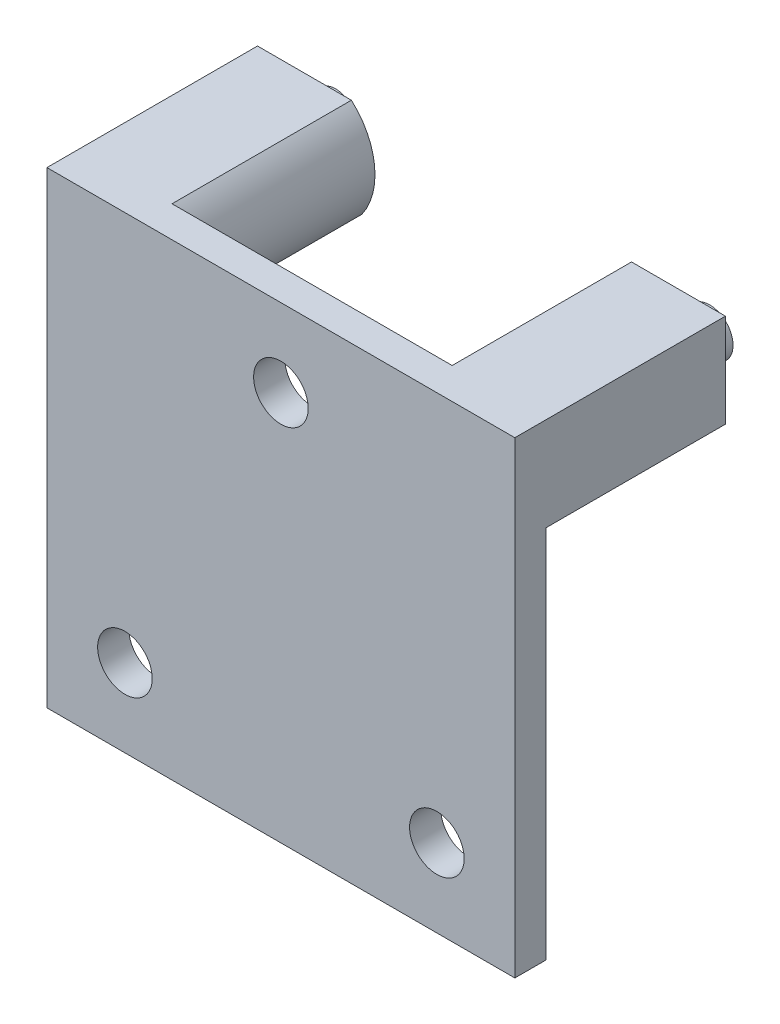
ISO-10303-21;
HEADER;
FILE_DESCRIPTION(('STEP AP214'),'2;1');
FILE_NAME('part.step','',(''),(''),'','','');
FILE_SCHEMA(('AUTOMOTIVE_DESIGN { 1 0 10303 214 1 1 1 1 }'));
ENDSEC;
DATA;
#1=APPLICATION_CONTEXT('core data for automotive mechanical design processes');
#2=APPLICATION_PROTOCOL_DEFINITION('international standard','automotive_design',2000,#1);
#3=PRODUCT_CONTEXT('',#1,'mechanical');
#4=PRODUCT('Part','Part','',(#3));
#5=PRODUCT_RELATED_PRODUCT_CATEGORY('part','',(#4));
#6=PRODUCT_DEFINITION_FORMATION('','',#4);
#7=PRODUCT_DEFINITION_CONTEXT('part definition',#1,'design');
#8=PRODUCT_DEFINITION('design','',#6,#7);
#9=PRODUCT_DEFINITION_SHAPE('','',#8);
#10=(LENGTH_UNIT() NAMED_UNIT(*) SI_UNIT(.MILLI.,.METRE.));
#11=(NAMED_UNIT(*) PLANE_ANGLE_UNIT() SI_UNIT($,.RADIAN.));
#12=(NAMED_UNIT(*) SI_UNIT($,.STERADIAN.) SOLID_ANGLE_UNIT());
#13=UNCERTAINTY_MEASURE_WITH_UNIT(LENGTH_MEASURE(1.E-05),#10,'distance_accuracy_value','');
#14=(GEOMETRIC_REPRESENTATION_CONTEXT(3) GLOBAL_UNCERTAINTY_ASSIGNED_CONTEXT((#13)) GLOBAL_UNIT_ASSIGNED_CONTEXT((#10,
#11,#12)) REPRESENTATION_CONTEXT('',''));
#15=CARTESIAN_POINT('',(0.,0.,0.));
#16=DIRECTION('',(0.,0.,1.));
#17=DIRECTION('',(1.,0.,0.));
#18=AXIS2_PLACEMENT_3D('',#15,#16,#17);
#19=CARTESIAN_POINT('',(-0.00991820608002309,-5.87499477855901,2.));
#20=DIRECTION('',(1.,0.,0.));
#21=DIRECTION('',(0.,0.,-1.));
#22=AXIS2_PLACEMENT_3D('',#19,#20,#21);
#23=PLANE('',#22);
#24=DIRECTION('',(0.,0.,-1.));
#25=VECTOR('',#24,1.);
#26=CARTESIAN_POINT('',(-0.00991820608002309,24.125005221441,2.));
#27=LINE('',#26,#25);
#28=CARTESIAN_POINT('',(-0.00991820608002309,24.125005221441,2.));
#29=VERTEX_POINT('',#28);
#30=CARTESIAN_POINT('',(-0.00991820608002309,24.125005221441,-11.5));
#31=VERTEX_POINT('',#30);
#32=EDGE_CURVE('E123',#29,#31,#27,.T.);
#33=ORIENTED_EDGE('',*,*,#32,.T.);
#34=DIRECTION('',(0.,1.,0.));
#35=VECTOR('',#34,1.);
#36=CARTESIAN_POINT('',(-0.00991820608002309,24.125005221441,-11.5));
#37=LINE('',#36,#35);
#38=CARTESIAN_POINT('',(-0.00991820608002309,18.125005221441,-11.5));
#39=VERTEX_POINT('',#38);
#40=EDGE_CURVE('E168',#39,#31,#37,.T.);
#41=ORIENTED_EDGE('',*,*,#40,.F.);
#42=DIRECTION('',(0.,0.,1.));
#43=VECTOR('',#42,1.);
#44=CARTESIAN_POINT('',(-0.00991820608002309,18.125005221441,-11.5));
#45=LINE('',#44,#43);
#46=CARTESIAN_POINT('',(-0.00991820608002309,18.125005221441,0.));
#47=VERTEX_POINT('',#46);
#48=EDGE_CURVE('E171',#39,#47,#45,.T.);
#49=ORIENTED_EDGE('',*,*,#48,.T.);
#50=DIRECTION('',(0.,-1.,0.));
#51=VECTOR('',#50,1.);
#52=CARTESIAN_POINT('',(-0.00991820608002309,-5.87499477855901,0.));
#53=LINE('',#52,#51);
#54=CARTESIAN_POINT('',(-0.00991820608002309,-5.87499477855901,0.));
#55=VERTEX_POINT('',#54);
#56=EDGE_CURVE('E199',#47,#55,#53,.T.);
#57=ORIENTED_EDGE('',*,*,#56,.T.);
#58=DIRECTION('',(0.,0.,-1.));
#59=VECTOR('',#58,1.);
#60=CARTESIAN_POINT('',(-0.00991820608002309,-5.87499477855901,2.));
#61=LINE('',#60,#59);
#62=CARTESIAN_POINT('',(-0.00991820608002309,-5.87499477855901,2.));
#63=VERTEX_POINT('',#62);
#64=EDGE_CURVE('E196',#63,#55,#61,.T.);
#65=ORIENTED_EDGE('',*,*,#64,.F.);
#66=DIRECTION('',(0.,-1.,0.));
#67=VECTOR('',#66,1.);
#68=CARTESIAN_POINT('',(-0.00991820608002309,-5.87499477855901,2.));
#69=LINE('',#68,#67);
#70=EDGE_CURVE('E187',#29,#63,#69,.T.);
#71=ORIENTED_EDGE('',*,*,#70,.F.);
#72=EDGE_LOOP('',(#33,#41,#49,#57,#65,#71));
#73=FACE_BOUND('',#72,.T.);
#74=ADVANCED_FACE('F35',(#73),#23,.F.);
#75=CARTESIAN_POINT('',(29.99008179392,-5.87499477855901,2.));
#76=DIRECTION('',(0.,1.,0.));
#77=DIRECTION('',(-1.,0.,0.));
#78=AXIS2_PLACEMENT_3D('',#75,#76,#77);
#79=PLANE('',#78);
#80=DIRECTION('',(1.,0.,0.));
#81=VECTOR('',#80,1.);
#82=CARTESIAN_POINT('',(29.99008179392,-5.87499477855901,0.));
#83=LINE('',#82,#81);
#84=CARTESIAN_POINT('',(29.99008179392,-5.87499477855901,0.));
#85=VERTEX_POINT('',#84);
#86=EDGE_CURVE('E202',#55,#85,#83,.T.);
#87=ORIENTED_EDGE('',*,*,#86,.T.);
#88=DIRECTION('',(0.,0.,-1.));
#89=VECTOR('',#88,1.);
#90=CARTESIAN_POINT('',(29.99008179392,-5.87499477855901,2.));
#91=LINE('',#90,#89);
#92=CARTESIAN_POINT('',(29.99008179392,-5.87499477855901,2.));
#93=VERTEX_POINT('',#92);
#94=EDGE_CURVE('E122',#93,#85,#91,.T.);
#95=ORIENTED_EDGE('',*,*,#94,.F.);
#96=DIRECTION('',(1.,0.,0.));
#97=VECTOR('',#96,1.);
#98=CARTESIAN_POINT('',(29.99008179392,-5.87499477855901,2.));
#99=LINE('',#98,#97);
#100=EDGE_CURVE('E253',#63,#93,#99,.T.);
#101=ORIENTED_EDGE('',*,*,#100,.F.);
#102=ORIENTED_EDGE('',*,*,#64,.T.);
#103=EDGE_LOOP('',(#87,#95,#101,#102));
#104=FACE_BOUND('',#103,.T.);
#105=ADVANCED_FACE('F230',(#104),#79,.F.);
#106=CARTESIAN_POINT('',(29.99008179392,-5.87499477855901,2.));
#107=DIRECTION('',(-1.,0.,0.));
#108=DIRECTION('',(0.,0.,1.));
#109=AXIS2_PLACEMENT_3D('',#106,#107,#108);
#110=PLANE('',#109);
#111=DIRECTION('',(0.,1.,0.));
#112=VECTOR('',#111,1.);
#113=CARTESIAN_POINT('',(29.99008179392,-5.87499477855901,0.));
#114=LINE('',#113,#112);
#115=CARTESIAN_POINT('',(29.99008179392,18.125005221441,0.));
#116=VERTEX_POINT('',#115);
#117=EDGE_CURVE('E188',#85,#116,#114,.T.);
#118=ORIENTED_EDGE('',*,*,#117,.T.);
#119=DIRECTION('',(0.,0.,1.));
#120=VECTOR('',#119,1.);
#121=CARTESIAN_POINT('',(29.99008179392,18.125005221441,-11.5));
#122=LINE('',#121,#120);
#123=CARTESIAN_POINT('',(29.99008179392,18.125005221441,-11.5));
#124=VERTEX_POINT('',#123);
#125=EDGE_CURVE('E137',#124,#116,#122,.T.);
#126=ORIENTED_EDGE('',*,*,#125,.F.);
#127=DIRECTION('',(0.,1.,0.));
#128=VECTOR('',#127,1.);
#129=CARTESIAN_POINT('',(29.99008179392,24.125005221441,-11.5));
#130=LINE('',#129,#128);
#131=CARTESIAN_POINT('',(29.99008179392,24.125005221441,-11.5));
#132=VERTEX_POINT('',#131);
#133=EDGE_CURVE('E129',#124,#132,#130,.T.);
#134=ORIENTED_EDGE('',*,*,#133,.T.);
#135=DIRECTION('',(0.,0.,-1.));
#136=VECTOR('',#135,1.);
#137=CARTESIAN_POINT('',(29.99008179392,24.125005221441,2.));
#138=LINE('',#137,#136);
#139=CARTESIAN_POINT('',(29.99008179392,24.125005221441,2.));
#140=VERTEX_POINT('',#139);
#141=EDGE_CURVE('E112',#140,#132,#138,.T.);
#142=ORIENTED_EDGE('',*,*,#141,.F.);
#143=DIRECTION('',(0.,1.,0.));
#144=VECTOR('',#143,1.);
#145=CARTESIAN_POINT('',(29.99008179392,-5.87499477855901,2.));
#146=LINE('',#145,#144);
#147=EDGE_CURVE('E255',#93,#140,#146,.T.);
#148=ORIENTED_EDGE('',*,*,#147,.F.);
#149=ORIENTED_EDGE('',*,*,#94,.T.);
#150=EDGE_LOOP('',(#118,#126,#134,#142,#148,#149));
#151=FACE_BOUND('',#150,.T.);
#152=ADVANCED_FACE('F136',(#151),#110,.F.);
#153=CARTESIAN_POINT('',(29.99008179392,24.125005221441,2.));
#154=DIRECTION('',(0.,-1.,0.));
#155=DIRECTION('',(0.,0.,-1.));
#156=AXIS2_PLACEMENT_3D('',#153,#154,#155);
#157=PLANE('',#156);
#158=ORIENTED_EDGE('',*,*,#141,.T.);
#159=DIRECTION('',(-1.,0.,0.));
#160=VECTOR('',#159,1.);
#161=CARTESIAN_POINT('',(29.99008179392,24.125005221441,-11.5));
#162=LINE('',#161,#160);
#163=CARTESIAN_POINT('',(23.9702421417599,24.125005221441,-11.5));
#164=VERTEX_POINT('',#163);
#165=EDGE_CURVE('E115',#132,#164,#162,.T.);
#166=ORIENTED_EDGE('',*,*,#165,.T.);
#167=DIRECTION('',(0.,0.,1.));
#168=VECTOR('',#167,1.);
#169=CARTESIAN_POINT('',(23.9702421417599,24.125005221441,-11.5));
#170=LINE('',#169,#168);
#171=CARTESIAN_POINT('',(23.9702421417599,24.125005221441,0.));
#172=VERTEX_POINT('',#171);
#173=EDGE_CURVE('E144',#164,#172,#170,.T.);
#174=ORIENTED_EDGE('',*,*,#173,.T.);
#175=DIRECTION('',(-1.,0.,0.));
#176=VECTOR('',#175,1.);
#177=CARTESIAN_POINT('',(29.99008179392,24.125005221441,0.));
#178=LINE('',#177,#176);
#179=CARTESIAN_POINT('',(6.00992144608002,24.125005221441,0.));
#180=VERTEX_POINT('',#179);
#181=EDGE_CURVE('E57',#172,#180,#178,.T.);
#182=ORIENTED_EDGE('',*,*,#181,.T.);
#183=DIRECTION('',(0.,0.,1.));
#184=VECTOR('',#183,1.);
#185=CARTESIAN_POINT('',(6.00992144608002,24.125005221441,-11.5));
#186=LINE('',#185,#184);
#187=CARTESIAN_POINT('',(6.00992144608002,24.125005221441,-11.5));
#188=VERTEX_POINT('',#187);
#189=EDGE_CURVE('E203',#188,#180,#186,.T.);
#190=ORIENTED_EDGE('',*,*,#189,.F.);
#191=DIRECTION('',(1.,0.,0.));
#192=VECTOR('',#191,1.);
#193=CARTESIAN_POINT('',(-0.00991820608002309,24.125005221441,-11.5));
#194=LINE('',#193,#192);
#195=EDGE_CURVE('E160',#31,#188,#194,.T.);
#196=ORIENTED_EDGE('',*,*,#195,.F.);
#197=ORIENTED_EDGE('',*,*,#32,.F.);
#198=DIRECTION('',(-1.,0.,0.));
#199=VECTOR('',#198,1.);
#200=CARTESIAN_POINT('',(29.99008179392,24.125005221441,2.));
#201=LINE('',#200,#199);
#202=EDGE_CURVE('E118',#140,#29,#201,.T.);
#203=ORIENTED_EDGE('',*,*,#202,.F.);
#204=EDGE_LOOP('',(#158,#166,#174,#182,#190,#196,#197,#203));
#205=FACE_BOUND('',#204,.T.);
#206=ADVANCED_FACE('F114',(#205),#157,.F.);
#207=CARTESIAN_POINT('',(0.,0.,2.));
#208=DIRECTION('',(0.,0.,1.));
#209=DIRECTION('',(1.,0.,0.));
#210=AXIS2_PLACEMENT_3D('',#207,#208,#209);
#211=PLANE('',#210);
#212=CARTESIAN_POINT('',(14.99008179392,19.125005221441,2.));
#213=DIRECTION('',(0.,0.,-1.));
#214=DIRECTION('',(-1.,0.,0.));
#215=AXIS2_PLACEMENT_3D('',#212,#213,#214);
#216=CIRCLE('',#215,1.75);
#217=CARTESIAN_POINT('',(13.24008179392,19.125005221441,2.));
#218=VERTEX_POINT('',#217);
#219=EDGE_CURVE('E411',#218,#218,#216,.T.);
#220=ORIENTED_EDGE('',*,*,#219,.T.);
#221=EDGE_LOOP('',(#220));
#222=FACE_BOUND('',#221,.T.);
#223=CARTESIAN_POINT('',(4.99008179391998,-0.874994778559009,2.));
#224=DIRECTION('',(0.,0.,-1.));
#225=DIRECTION('',(1.,0.,0.));
#226=AXIS2_PLACEMENT_3D('',#223,#224,#225);
#227=CIRCLE('',#226,1.75);
#228=CARTESIAN_POINT('',(6.74008179391998,-0.874994778559009,2.));
#229=VERTEX_POINT('',#228);
#230=EDGE_CURVE('E419',#229,#229,#227,.T.);
#231=ORIENTED_EDGE('',*,*,#230,.T.);
#232=EDGE_LOOP('',(#231));
#233=FACE_BOUND('',#232,.T.);
#234=CARTESIAN_POINT('',(24.99008179392,-0.874994778559009,2.));
#235=DIRECTION('',(0.,0.,-1.));
#236=DIRECTION('',(-1.,0.,0.));
#237=AXIS2_PLACEMENT_3D('',#234,#235,#236);
#238=CIRCLE('',#237,1.75);
#239=CARTESIAN_POINT('',(23.24008179392,-0.874994778559009,2.));
#240=VERTEX_POINT('',#239);
#241=EDGE_CURVE('E425',#240,#240,#238,.T.);
#242=ORIENTED_EDGE('',*,*,#241,.T.);
#243=EDGE_LOOP('',(#242));
#244=FACE_BOUND('',#243,.T.);
#245=ORIENTED_EDGE('',*,*,#70,.T.);
#246=ORIENTED_EDGE('',*,*,#100,.T.);
#247=ORIENTED_EDGE('',*,*,#147,.T.);
#248=ORIENTED_EDGE('',*,*,#202,.T.);
#249=EDGE_LOOP('',(#245,#246,#247,#248));
#250=FACE_BOUND('',#249,.T.);
#251=ADVANCED_FACE('F257',(#222,#233,#244,#250),#211,.T.);
#252=CARTESIAN_POINT('',(0.,0.,0.));
#253=DIRECTION('',(0.,0.,1.));
#254=DIRECTION('',(1.,0.,0.));
#255=AXIS2_PLACEMENT_3D('',#252,#253,#254);
#256=PLANE('',#255);
#257=CARTESIAN_POINT('',(14.99008179392,19.125005221441,0.));
#258=DIRECTION('',(0.,0.,-1.));
#259=DIRECTION('',(-1.,0.,0.));
#260=AXIS2_PLACEMENT_3D('',#257,#258,#259);
#261=CIRCLE('',#260,1.75);
#262=CARTESIAN_POINT('',(13.24008179392,19.125005221441,0.));
#263=VERTEX_POINT('',#262);
#264=EDGE_CURVE('E414',#263,#263,#261,.T.);
#265=ORIENTED_EDGE('',*,*,#264,.F.);
#266=EDGE_LOOP('',(#265));
#267=FACE_BOUND('',#266,.T.);
#268=CARTESIAN_POINT('',(4.99008179391998,-0.874994778559009,0.));
#269=DIRECTION('',(0.,0.,-1.));
#270=DIRECTION('',(1.,0.,0.));
#271=AXIS2_PLACEMENT_3D('',#268,#269,#270);
#272=CIRCLE('',#271,1.75);
#273=CARTESIAN_POINT('',(6.74008179391998,-0.874994778559009,0.));
#274=VERTEX_POINT('',#273);
#275=EDGE_CURVE('E416',#274,#274,#272,.T.);
#276=ORIENTED_EDGE('',*,*,#275,.F.);
#277=EDGE_LOOP('',(#276));
#278=FACE_BOUND('',#277,.T.);
#279=CARTESIAN_POINT('',(24.99008179392,-0.874994778559009,0.));
#280=DIRECTION('',(0.,0.,-1.));
#281=DIRECTION('',(-1.,0.,0.));
#282=AXIS2_PLACEMENT_3D('',#279,#280,#281);
#283=CIRCLE('',#282,1.75);
#284=CARTESIAN_POINT('',(23.24008179392,-0.874994778559009,0.));
#285=VERTEX_POINT('',#284);
#286=EDGE_CURVE('E422',#285,#285,#283,.T.);
#287=ORIENTED_EDGE('',*,*,#286,.F.);
#288=EDGE_LOOP('',(#287));
#289=FACE_BOUND('',#288,.T.);
#290=CARTESIAN_POINT('',(13.707999,3.46499688,0.));
#291=DIRECTION('',(0.,0.,1.));
#292=DIRECTION('',(1.,0.,0.));
#293=AXIS2_PLACEMENT_3D('',#290,#291,#292);
#294=CIRCLE('',#293,5.);
#295=CARTESIAN_POINT('',(18.707999,3.46499688,0.));
#296=VERTEX_POINT('',#295);
#297=EDGE_CURVE('E11',#296,#296,#294,.F.);
#298=ORIENTED_EDGE('',*,*,#297,.F.);
#299=EDGE_LOOP('',(#298));
#300=FACE_BOUND('',#299,.T.);
#301=CARTESIAN_POINT('',(26.98016196784,20.74999914,0.));
#302=DIRECTION('',(0.,0.,1.));
#303=DIRECTION('',(1.,0.,0.));
#304=AXIS2_PLACEMENT_3D('',#301,#302,#303);
#305=CIRCLE('',#304,4.52219895727657);
#306=CARTESIAN_POINT('',(23.2978134866772,18.125005221441,0.));
#307=VERTEX_POINT('',#306);
#308=EDGE_CURVE('E133',#172,#307,#305,.T.);
#309=ORIENTED_EDGE('',*,*,#308,.T.);
#310=DIRECTION('',(1.,0.,0.));
#311=VECTOR('',#310,1.);
#312=CARTESIAN_POINT('',(29.99008179392,18.125005221441,0.));
#313=LINE('',#312,#311);
#314=EDGE_CURVE('E49',#307,#116,#313,.T.);
#315=ORIENTED_EDGE('',*,*,#314,.T.);
#316=ORIENTED_EDGE('',*,*,#117,.F.);
#317=ORIENTED_EDGE('',*,*,#86,.F.);
#318=ORIENTED_EDGE('',*,*,#56,.F.);
#319=DIRECTION('',(-1.,0.,0.));
#320=VECTOR('',#319,1.);
#321=CARTESIAN_POINT('',(-0.00991820608002309,18.125005221441,0.));
#322=LINE('',#321,#320);
#323=CARTESIAN_POINT('',(6.68235010116273,18.125005221441,0.));
#324=VERTEX_POINT('',#323);
#325=EDGE_CURVE('E164',#324,#47,#322,.T.);
#326=ORIENTED_EDGE('',*,*,#325,.F.);
#327=CARTESIAN_POINT('',(3.00000162,20.74999914,0.));
#328=DIRECTION('',(0.,0.,-1.));
#329=DIRECTION('',(-1.,0.,0.));
#330=AXIS2_PLACEMENT_3D('',#327,#328,#329);
#331=CIRCLE('',#330,4.52219895727657);
#332=EDGE_CURVE('E157',#180,#324,#331,.T.);
#333=ORIENTED_EDGE('',*,*,#332,.F.);
#334=ORIENTED_EDGE('',*,*,#181,.F.);
#335=EDGE_LOOP('',(#309,#315,#316,#317,#318,#326,#333,#334));
#336=FACE_BOUND('',#335,.T.);
#337=ADVANCED_FACE('F213',(#267,#278,#289,#300,#336),#256,.F.);
#338=CARTESIAN_POINT('',(3.00000162,20.74999914,-11.5));
#339=DIRECTION('',(0.,0.,1.));
#340=DIRECTION('',(1.,0.,0.));
#341=AXIS2_PLACEMENT_3D('',#338,#339,#340);
#342=CYLINDRICAL_SURFACE('',#341,4.52219895727657);
#343=ORIENTED_EDGE('',*,*,#332,.T.);
#344=DIRECTION('',(0.,0.,1.));
#345=VECTOR('',#344,1.);
#346=CARTESIAN_POINT('',(6.68235010116273,18.125005221441,-11.5));
#347=LINE('',#346,#345);
#348=CARTESIAN_POINT('',(6.68235010116273,18.125005221441,-11.5));
#349=VERTEX_POINT('',#348);
#350=EDGE_CURVE('E174',#349,#324,#347,.T.);
#351=ORIENTED_EDGE('',*,*,#350,.F.);
#352=CARTESIAN_POINT('',(3.00000162,20.74999914,-11.5));
#353=DIRECTION('',(0.,0.,-1.));
#354=DIRECTION('',(-1.,0.,0.));
#355=AXIS2_PLACEMENT_3D('',#352,#353,#354);
#356=CIRCLE('',#355,4.52219895727657);
#357=EDGE_CURVE('E163',#188,#349,#356,.T.);
#358=ORIENTED_EDGE('',*,*,#357,.F.);
#359=ORIENTED_EDGE('',*,*,#189,.T.);
#360=EDGE_LOOP('',(#343,#351,#358,#359));
#361=FACE_BOUND('',#360,.T.);
#362=ADVANCED_FACE('F252',(#361),#342,.T.);
#363=CARTESIAN_POINT('',(-0.00991820608002309,18.125005221441,-11.5));
#364=DIRECTION('',(0.,1.,0.));
#365=DIRECTION('',(0.,0.,1.));
#366=AXIS2_PLACEMENT_3D('',#363,#364,#365);
#367=PLANE('',#366);
#368=ORIENTED_EDGE('',*,*,#325,.T.);
#369=ORIENTED_EDGE('',*,*,#48,.F.);
#370=DIRECTION('',(-1.,0.,0.));
#371=VECTOR('',#370,1.);
#372=CARTESIAN_POINT('',(-0.00991820608002309,18.125005221441,-11.5));
#373=LINE('',#372,#371);
#374=EDGE_CURVE('E166',#349,#39,#373,.T.);
#375=ORIENTED_EDGE('',*,*,#374,.F.);
#376=ORIENTED_EDGE('',*,*,#350,.T.);
#377=EDGE_LOOP('',(#368,#369,#375,#376));
#378=FACE_BOUND('',#377,.T.);
#379=ADVANCED_FACE('F251',(#378),#367,.F.);
#380=CARTESIAN_POINT('',(3.00000162,20.74999914,-11.5));
#381=DIRECTION('',(0.,0.,-1.));
#382=DIRECTION('',(-1.,0.,0.));
#383=AXIS2_PLACEMENT_3D('',#380,#381,#382);
#384=PLANE('',#383);
#385=CARTESIAN_POINT('',(3.00000162,20.74999914,-11.5));
#386=DIRECTION('',(0.,0.,-1.));
#387=DIRECTION('',(-1.,0.,0.));
#388=AXIS2_PLACEMENT_3D('',#385,#386,#387);
#389=CIRCLE('',#388,1.5);
#390=CARTESIAN_POINT('',(1.50000162,20.74999914,-11.5));
#391=VERTEX_POINT('',#390);
#392=EDGE_CURVE('E153',#391,#391,#389,.T.);
#393=ORIENTED_EDGE('',*,*,#392,.F.);
#394=EDGE_LOOP('',(#393));
#395=FACE_BOUND('',#394,.T.);
#396=ORIENTED_EDGE('',*,*,#195,.T.);
#397=ORIENTED_EDGE('',*,*,#357,.T.);
#398=ORIENTED_EDGE('',*,*,#374,.T.);
#399=ORIENTED_EDGE('',*,*,#40,.T.);
#400=EDGE_LOOP('',(#396,#397,#398,#399));
#401=FACE_BOUND('',#400,.T.);
#402=ADVANCED_FACE('F241',(#395,#401),#384,.T.);
#403=CARTESIAN_POINT('',(3.00000162,20.74999914,-13.5));
#404=DIRECTION('',(0.,0.,1.));
#405=DIRECTION('',(1.,0.,0.));
#406=AXIS2_PLACEMENT_3D('',#403,#404,#405);
#407=CYLINDRICAL_SURFACE('',#406,1.5);
#408=CARTESIAN_POINT('',(3.00000162,20.74999914,-13.5));
#409=DIRECTION('',(0.,0.,-1.));
#410=DIRECTION('',(-1.,0.,0.));
#411=AXIS2_PLACEMENT_3D('',#408,#409,#410);
#412=CIRCLE('',#411,1.5);
#413=CARTESIAN_POINT('',(1.50000162,20.74999914,-13.5));
#414=VERTEX_POINT('',#413);
#415=EDGE_CURVE('E154',#414,#414,#412,.T.);
#416=ORIENTED_EDGE('',*,*,#415,.F.);
#417=EDGE_LOOP('',(#416));
#418=FACE_BOUND('',#417,.T.);
#419=ORIENTED_EDGE('',*,*,#392,.T.);
#420=EDGE_LOOP('',(#419));
#421=FACE_BOUND('',#420,.T.);
#422=ADVANCED_FACE('F226',(#418,#421),#407,.T.);
#423=CARTESIAN_POINT('',(3.00000162,20.74999914,-13.5));
#424=DIRECTION('',(0.,0.,-1.));
#425=DIRECTION('',(-1.,0.,0.));
#426=AXIS2_PLACEMENT_3D('',#423,#424,#425);
#427=PLANE('',#426);
#428=ORIENTED_EDGE('',*,*,#415,.T.);
#429=EDGE_LOOP('',(#428));
#430=FACE_BOUND('',#429,.T.);
#431=ADVANCED_FACE('F219',(#430),#427,.T.);
#432=CARTESIAN_POINT('',(29.99008179392,18.125005221441,-11.5));
#433=DIRECTION('',(0.,-1.,0.));
#434=DIRECTION('',(0.,0.,-1.));
#435=AXIS2_PLACEMENT_3D('',#432,#433,#434);
#436=PLANE('',#435);
#437=ORIENTED_EDGE('',*,*,#314,.F.);
#438=DIRECTION('',(0.,0.,1.));
#439=VECTOR('',#438,1.);
#440=CARTESIAN_POINT('',(23.2978134866772,18.125005221441,-11.5));
#441=LINE('',#440,#439);
#442=CARTESIAN_POINT('',(23.2978134866772,18.125005221441,-11.5));
#443=VERTEX_POINT('',#442);
#444=EDGE_CURVE('E150',#443,#307,#441,.T.);
#445=ORIENTED_EDGE('',*,*,#444,.F.);
#446=DIRECTION('',(1.,0.,0.));
#447=VECTOR('',#446,1.);
#448=CARTESIAN_POINT('',(29.99008179392,18.125005221441,-11.5));
#449=LINE('',#448,#447);
#450=EDGE_CURVE('E138',#443,#124,#449,.T.);
#451=ORIENTED_EDGE('',*,*,#450,.T.);
#452=ORIENTED_EDGE('',*,*,#125,.T.);
#453=EDGE_LOOP('',(#437,#445,#451,#452));
#454=FACE_BOUND('',#453,.T.);
#455=ADVANCED_FACE('F217',(#454),#436,.T.);
#456=CARTESIAN_POINT('',(26.98016196784,20.74999914,-11.5));
#457=DIRECTION('',(0.,0.,1.));
#458=DIRECTION('',(1.,0.,0.));
#459=AXIS2_PLACEMENT_3D('',#456,#457,#458);
#460=CYLINDRICAL_SURFACE('',#459,4.52219895727657);
#461=ORIENTED_EDGE('',*,*,#308,.F.);
#462=ORIENTED_EDGE('',*,*,#173,.F.);
#463=CARTESIAN_POINT('',(26.98016196784,20.74999914,-11.5));
#464=DIRECTION('',(0.,0.,1.));
#465=DIRECTION('',(1.,0.,0.));
#466=AXIS2_PLACEMENT_3D('',#463,#464,#465);
#467=CIRCLE('',#466,4.52219895727657);
#468=EDGE_CURVE('E132',#164,#443,#467,.T.);
#469=ORIENTED_EDGE('',*,*,#468,.T.);
#470=ORIENTED_EDGE('',*,*,#444,.T.);
#471=EDGE_LOOP('',(#461,#462,#469,#470));
#472=FACE_BOUND('',#471,.T.);
#473=ADVANCED_FACE('F216',(#472),#460,.T.);
#474=CARTESIAN_POINT('',(26.98016196784,20.74999914,-11.5));
#475=DIRECTION('',(0.,0.,-1.));
#476=DIRECTION('',(1.,0.,0.));
#477=AXIS2_PLACEMENT_3D('',#474,#475,#476);
#478=PLANE('',#477);
#479=CARTESIAN_POINT('',(26.98016196784,20.74999914,-11.5));
#480=DIRECTION('',(0.,0.,-1.));
#481=DIRECTION('',(-1.,0.,0.));
#482=AXIS2_PLACEMENT_3D('',#479,#480,#481);
#483=CIRCLE('',#482,1.5);
#484=CARTESIAN_POINT('',(25.48016196784,20.74999914,-11.5));
#485=VERTEX_POINT('',#484);
#486=EDGE_CURVE('E42',#485,#485,#483,.T.);
#487=ORIENTED_EDGE('',*,*,#486,.F.);
#488=EDGE_LOOP('',(#487));
#489=FACE_BOUND('',#488,.T.);
#490=ORIENTED_EDGE('',*,*,#165,.F.);
#491=ORIENTED_EDGE('',*,*,#133,.F.);
#492=ORIENTED_EDGE('',*,*,#450,.F.);
#493=ORIENTED_EDGE('',*,*,#468,.F.);
#494=EDGE_LOOP('',(#490,#491,#492,#493));
#495=FACE_BOUND('',#494,.T.);
#496=ADVANCED_FACE('F127',(#489,#495),#478,.T.);
#497=CARTESIAN_POINT('',(26.98016196784,20.74999914,-13.5));
#498=DIRECTION('',(0.,0.,1.));
#499=DIRECTION('',(1.,0.,0.));
#500=AXIS2_PLACEMENT_3D('',#497,#498,#499);
#501=CYLINDRICAL_SURFACE('',#500,1.5);
#502=CARTESIAN_POINT('',(26.98016196784,20.74999914,-13.5));
#503=DIRECTION('',(0.,0.,1.));
#504=DIRECTION('',(1.,0.,0.));
#505=AXIS2_PLACEMENT_3D('',#502,#503,#504);
#506=CIRCLE('',#505,1.5);
#507=CARTESIAN_POINT('',(28.48016196784,20.74999914,-13.5));
#508=VERTEX_POINT('',#507);
#509=EDGE_CURVE('E146',#508,#508,#506,.T.);
#510=ORIENTED_EDGE('',*,*,#509,.T.);
#511=EDGE_LOOP('',(#510));
#512=FACE_BOUND('',#511,.T.);
#513=ORIENTED_EDGE('',*,*,#486,.T.);
#514=EDGE_LOOP('',(#513));
#515=FACE_BOUND('',#514,.T.);
#516=ADVANCED_FACE('F304',(#512,#515),#501,.T.);
#517=CARTESIAN_POINT('',(26.98016196784,20.74999914,-13.5));
#518=DIRECTION('',(0.,0.,-1.));
#519=DIRECTION('',(1.,0.,0.));
#520=AXIS2_PLACEMENT_3D('',#517,#518,#519);
#521=PLANE('',#520);
#522=ORIENTED_EDGE('',*,*,#509,.F.);
#523=EDGE_LOOP('',(#522));
#524=FACE_BOUND('',#523,.T.);
#525=ADVANCED_FACE('F314',(#524),#521,.T.);
#526=CARTESIAN_POINT('',(13.707999,3.46499688,-5.));
#527=DIRECTION('',(0.,0.,-1.));
#528=DIRECTION('',(-1.,0.,0.));
#529=AXIS2_PLACEMENT_3D('',#526,#527,#528);
#530=PLANE('',#529);
#531=CARTESIAN_POINT('',(13.707999,3.46499688,-5.));
#532=DIRECTION('',(0.,0.,-1.));
#533=DIRECTION('',(-1.,0.,0.));
#534=AXIS2_PLACEMENT_3D('',#531,#532,#533);
#535=CIRCLE('',#534,5.);
#536=CARTESIAN_POINT('',(8.707999,3.46499688,-5.));
#537=VERTEX_POINT('',#536);
#538=EDGE_CURVE('E434',#537,#537,#535,.T.);
#539=ORIENTED_EDGE('',*,*,#538,.T.);
#540=EDGE_LOOP('',(#539));
#541=FACE_BOUND('',#540,.T.);
#542=CARTESIAN_POINT('',(13.707999,3.46499688,-5.));
#543=DIRECTION('',(0.,0.,-1.));
#544=DIRECTION('',(-1.,0.,0.));
#545=AXIS2_PLACEMENT_3D('',#542,#543,#544);
#546=CIRCLE('',#545,3.5);
#547=CARTESIAN_POINT('',(10.207999,3.46499688,-5.));
#548=VERTEX_POINT('',#547);
#549=EDGE_CURVE('E431',#548,#548,#546,.T.);
#550=ORIENTED_EDGE('',*,*,#549,.F.);
#551=EDGE_LOOP('',(#550));
#552=FACE_BOUND('',#551,.T.);
#553=ADVANCED_FACE('F324',(#541,#552),#530,.T.);
#554=CARTESIAN_POINT('',(13.707999,3.46499688,-5.));
#555=DIRECTION('',(0.,0.,1.));
#556=DIRECTION('',(1.,0.,0.));
#557=AXIS2_PLACEMENT_3D('',#554,#555,#556);
#558=CYLINDRICAL_SURFACE('',#557,5.);
#559=ORIENTED_EDGE('',*,*,#538,.F.);
#560=EDGE_LOOP('',(#559));
#561=FACE_BOUND('',#560,.T.);
#562=ORIENTED_EDGE('',*,*,#297,.T.);
#563=EDGE_LOOP('',(#562));
#564=FACE_BOUND('',#563,.T.);
#565=ADVANCED_FACE('F335',(#561,#564),#558,.T.);
#566=CARTESIAN_POINT('',(13.707999,3.46499688,-5.));
#567=DIRECTION('',(0.,0.,1.));
#568=DIRECTION('',(1.,0.,0.));
#569=AXIS2_PLACEMENT_3D('',#566,#567,#568);
#570=CYLINDRICAL_SURFACE('',#569,3.5);
#571=ORIENTED_EDGE('',*,*,#549,.T.);
#572=EDGE_LOOP('',(#571));
#573=FACE_BOUND('',#572,.T.);
#574=CARTESIAN_POINT('',(13.707999,3.46499688,0.));
#575=DIRECTION('',(0.,0.,-1.));
#576=DIRECTION('',(-1.,0.,0.));
#577=AXIS2_PLACEMENT_3D('',#574,#575,#576);
#578=CIRCLE('',#577,3.5);
#579=CARTESIAN_POINT('',(10.207999,3.46499688,0.));
#580=VERTEX_POINT('',#579);
#581=EDGE_CURVE('E428',#580,#580,#578,.T.);
#582=ORIENTED_EDGE('',*,*,#581,.F.);
#583=EDGE_LOOP('',(#582));
#584=FACE_BOUND('',#583,.T.);
#585=ADVANCED_FACE('F345',(#573,#584),#570,.F.);
#586=ORIENTED_EDGE('',*,*,#581,.T.);
#587=EDGE_LOOP('',(#586));
#588=FACE_BOUND('',#587,.T.);
#589=ADVANCED_FACE('F267',(#588),#256,.F.);
#590=CARTESIAN_POINT('',(24.99008179392,-0.874994778559009,2.));
#591=DIRECTION('',(0.,0.,-1.));
#592=DIRECTION('',(-1.,0.,0.));
#593=AXIS2_PLACEMENT_3D('',#590,#591,#592);
#594=CYLINDRICAL_SURFACE('',#593,1.75);
#595=ORIENTED_EDGE('',*,*,#241,.F.);
#596=EDGE_LOOP('',(#595));
#597=FACE_BOUND('',#596,.T.);
#598=ORIENTED_EDGE('',*,*,#286,.T.);
#599=EDGE_LOOP('',(#598));
#600=FACE_BOUND('',#599,.T.);
#601=ADVANCED_FACE('F364',(#597,#600),#594,.F.);
#602=CARTESIAN_POINT('',(4.99008179391998,-0.874994778559009,2.));
#603=DIRECTION('',(0.,0.,-1.));
#604=DIRECTION('',(-1.,0.,0.));
#605=AXIS2_PLACEMENT_3D('',#602,#603,#604);
#606=CYLINDRICAL_SURFACE('',#605,1.75);
#607=ORIENTED_EDGE('',*,*,#230,.F.);
#608=EDGE_LOOP('',(#607));
#609=FACE_BOUND('',#608,.T.);
#610=ORIENTED_EDGE('',*,*,#275,.T.);
#611=EDGE_LOOP('',(#610));
#612=FACE_BOUND('',#611,.T.);
#613=ADVANCED_FACE('F385',(#609,#612),#606,.F.);
#614=CARTESIAN_POINT('',(14.99008179392,19.125005221441,2.));
#615=DIRECTION('',(0.,0.,-1.));
#616=DIRECTION('',(-1.,0.,0.));
#617=AXIS2_PLACEMENT_3D('',#614,#615,#616);
#618=CYLINDRICAL_SURFACE('',#617,1.75);
#619=ORIENTED_EDGE('',*,*,#219,.F.);
#620=EDGE_LOOP('',(#619));
#621=FACE_BOUND('',#620,.T.);
#622=ORIENTED_EDGE('',*,*,#264,.T.);
#623=EDGE_LOOP('',(#622));
#624=FACE_BOUND('',#623,.T.);
#625=ADVANCED_FACE('F395',(#621,#624),#618,.F.);
#626=CLOSED_SHELL('',(#74,#105,#152,#206,#251,#337,#362,#379,#402,#422,#431,#455,#473,#496,#516,
#525,#553,#565,#585,#589,#601,#613,#625));
#627=MANIFOLD_SOLID_BREP('B2',#626);
#628=ADVANCED_BREP_SHAPE_REPRESENTATION('',(#18,#627),#14);
#629=SHAPE_DEFINITION_REPRESENTATION(#9,#628);
ENDSEC;
END-ISO-10303-21;
